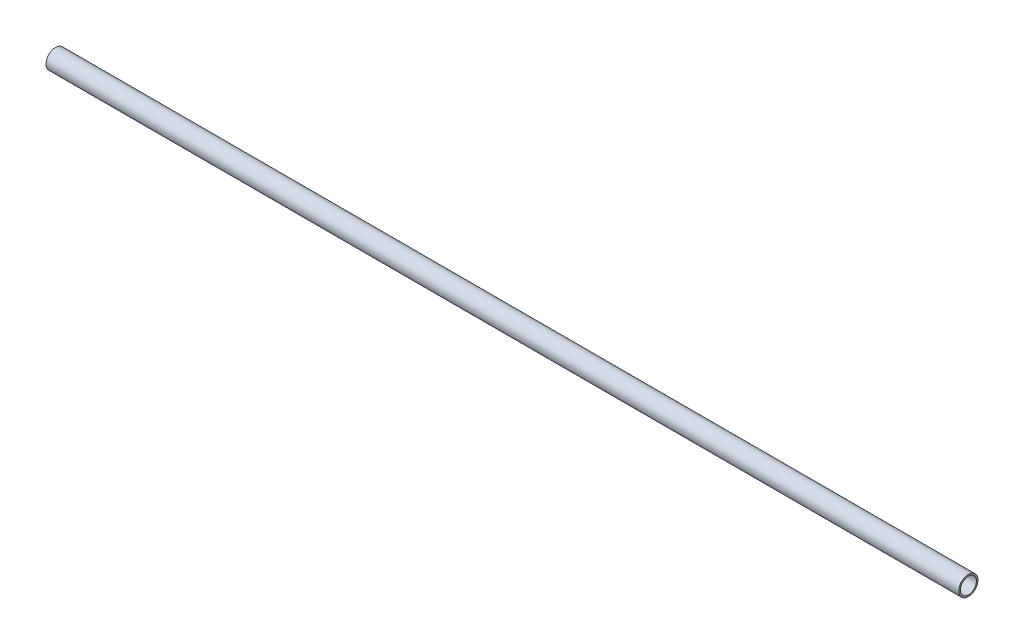
ISO-10303-21;
HEADER;
FILE_DESCRIPTION(('STEP AP214'),'2;1');
FILE_NAME('part.step','',(''),(''),'','','');
FILE_SCHEMA(('AUTOMOTIVE_DESIGN { 1 0 10303 214 1 1 1 1 }'));
ENDSEC;
DATA;
#1=APPLICATION_CONTEXT('core data for automotive mechanical design processes');
#2=APPLICATION_PROTOCOL_DEFINITION('international standard','automotive_design',2000,#1);
#3=PRODUCT_CONTEXT('',#1,'mechanical');
#4=PRODUCT('Part','Part','',(#3));
#5=PRODUCT_RELATED_PRODUCT_CATEGORY('part','',(#4));
#6=PRODUCT_DEFINITION_FORMATION('','',#4);
#7=PRODUCT_DEFINITION_CONTEXT('part definition',#1,'design');
#8=PRODUCT_DEFINITION('design','',#6,#7);
#9=PRODUCT_DEFINITION_SHAPE('','',#8);
#10=(LENGTH_UNIT() NAMED_UNIT(*) SI_UNIT(.MILLI.,.METRE.));
#11=(NAMED_UNIT(*) PLANE_ANGLE_UNIT() SI_UNIT($,.RADIAN.));
#12=(NAMED_UNIT(*) SI_UNIT($,.STERADIAN.) SOLID_ANGLE_UNIT());
#13=UNCERTAINTY_MEASURE_WITH_UNIT(LENGTH_MEASURE(1.E-05),#10,'distance_accuracy_value','');
#14=(GEOMETRIC_REPRESENTATION_CONTEXT(3) GLOBAL_UNCERTAINTY_ASSIGNED_CONTEXT((#13)) GLOBAL_UNIT_ASSIGNED_CONTEXT((#10,
#11,#12)) REPRESENTATION_CONTEXT('',''));
#15=CARTESIAN_POINT('',(0.,0.,0.));
#16=DIRECTION('',(0.,0.,1.));
#17=DIRECTION('',(1.,0.,0.));
#18=AXIS2_PLACEMENT_3D('',#15,#16,#17);
#19=CARTESIAN_POINT('',(-301.625,0.,0.));
#20=DIRECTION('',(1.,0.,0.));
#21=DIRECTION('',(0.,0.,-1.));
#22=AXIS2_PLACEMENT_3D('',#19,#20,#21);
#23=CYLINDRICAL_SURFACE('',#22,3.175);
#24=CARTESIAN_POINT('',(-301.625,0.,0.));
#25=DIRECTION('',(1.,0.,0.));
#26=DIRECTION('',(0.,0.,-1.));
#27=AXIS2_PLACEMENT_3D('',#24,#25,#26);
#28=CIRCLE('',#27,3.175);
#29=CARTESIAN_POINT('',(-301.625,0.,-3.175));
#30=VERTEX_POINT('',#29);
#31=EDGE_CURVE('E10',#30,#30,#28,.T.);
#32=ORIENTED_EDGE('',*,*,#31,.T.);
#33=EDGE_LOOP('',(#32));
#34=FACE_BOUND('',#33,.T.);
#35=CARTESIAN_POINT('',(0.,0.,0.));
#36=DIRECTION('',(1.,0.,0.));
#37=DIRECTION('',(0.,0.,-1.));
#38=AXIS2_PLACEMENT_3D('',#35,#36,#37);
#39=CIRCLE('',#38,3.175);
#40=CARTESIAN_POINT('',(0.,0.,-3.175));
#41=VERTEX_POINT('',#40);
#42=EDGE_CURVE('E40',#41,#41,#39,.T.);
#43=ORIENTED_EDGE('',*,*,#42,.F.);
#44=EDGE_LOOP('',(#43));
#45=FACE_BOUND('',#44,.T.);
#46=ADVANCED_FACE('F37',(#34,#45),#23,.T.);
#47=CARTESIAN_POINT('',(-301.625,0.,0.));
#48=DIRECTION('',(1.,0.,0.));
#49=DIRECTION('',(0.,0.,-1.));
#50=AXIS2_PLACEMENT_3D('',#47,#48,#49);
#51=PLANE('',#50);
#52=CARTESIAN_POINT('',(-301.625,0.,0.));
#53=DIRECTION('',(1.,0.,0.));
#54=DIRECTION('',(0.,0.,-1.));
#55=AXIS2_PLACEMENT_3D('',#52,#53,#54);
#56=CIRCLE('',#55,2.667);
#57=CARTESIAN_POINT('',(-301.625,0.,-2.667));
#58=VERTEX_POINT('',#57);
#59=EDGE_CURVE('E49',#58,#58,#56,.T.);
#60=ORIENTED_EDGE('',*,*,#59,.T.);
#61=EDGE_LOOP('',(#60));
#62=FACE_BOUND('',#61,.T.);
#63=ORIENTED_EDGE('',*,*,#31,.F.);
#64=EDGE_LOOP('',(#63));
#65=FACE_BOUND('',#64,.T.);
#66=ADVANCED_FACE('F59',(#62,#65),#51,.F.);
#67=CARTESIAN_POINT('',(0.,0.,0.));
#68=DIRECTION('',(1.,0.,0.));
#69=DIRECTION('',(0.,0.,-1.));
#70=AXIS2_PLACEMENT_3D('',#67,#68,#69);
#71=PLANE('',#70);
#72=CARTESIAN_POINT('',(0.,0.,0.));
#73=DIRECTION('',(1.,0.,0.));
#74=DIRECTION('',(0.,0.,-1.));
#75=AXIS2_PLACEMENT_3D('',#72,#73,#74);
#76=CIRCLE('',#75,2.667);
#77=CARTESIAN_POINT('',(0.,0.,-2.667));
#78=VERTEX_POINT('',#77);
#79=EDGE_CURVE('E51',#78,#78,#76,.T.);
#80=ORIENTED_EDGE('',*,*,#79,.F.);
#81=EDGE_LOOP('',(#80));
#82=FACE_BOUND('',#81,.T.);
#83=ORIENTED_EDGE('',*,*,#42,.T.);
#84=EDGE_LOOP('',(#83));
#85=FACE_BOUND('',#84,.T.);
#86=ADVANCED_FACE('F65',(#82,#85),#71,.T.);
#87=CARTESIAN_POINT('',(-301.625,0.,0.));
#88=DIRECTION('',(1.,0.,0.));
#89=DIRECTION('',(0.,0.,-1.));
#90=AXIS2_PLACEMENT_3D('',#87,#88,#89);
#91=CYLINDRICAL_SURFACE('',#90,2.667);
#92=ORIENTED_EDGE('',*,*,#59,.F.);
#93=EDGE_LOOP('',(#92));
#94=FACE_BOUND('',#93,.T.);
#95=ORIENTED_EDGE('',*,*,#79,.T.);
#96=EDGE_LOOP('',(#95));
#97=FACE_BOUND('',#96,.T.);
#98=ADVANCED_FACE('F62',(#94,#97),#91,.F.);
#99=CLOSED_SHELL('',(#46,#66,#86,#98));
#100=MANIFOLD_SOLID_BREP('B2',#99);
#101=ADVANCED_BREP_SHAPE_REPRESENTATION('',(#18,#100),#14);
#102=SHAPE_DEFINITION_REPRESENTATION(#9,#101);
ENDSEC;
END-ISO-10303-21;
